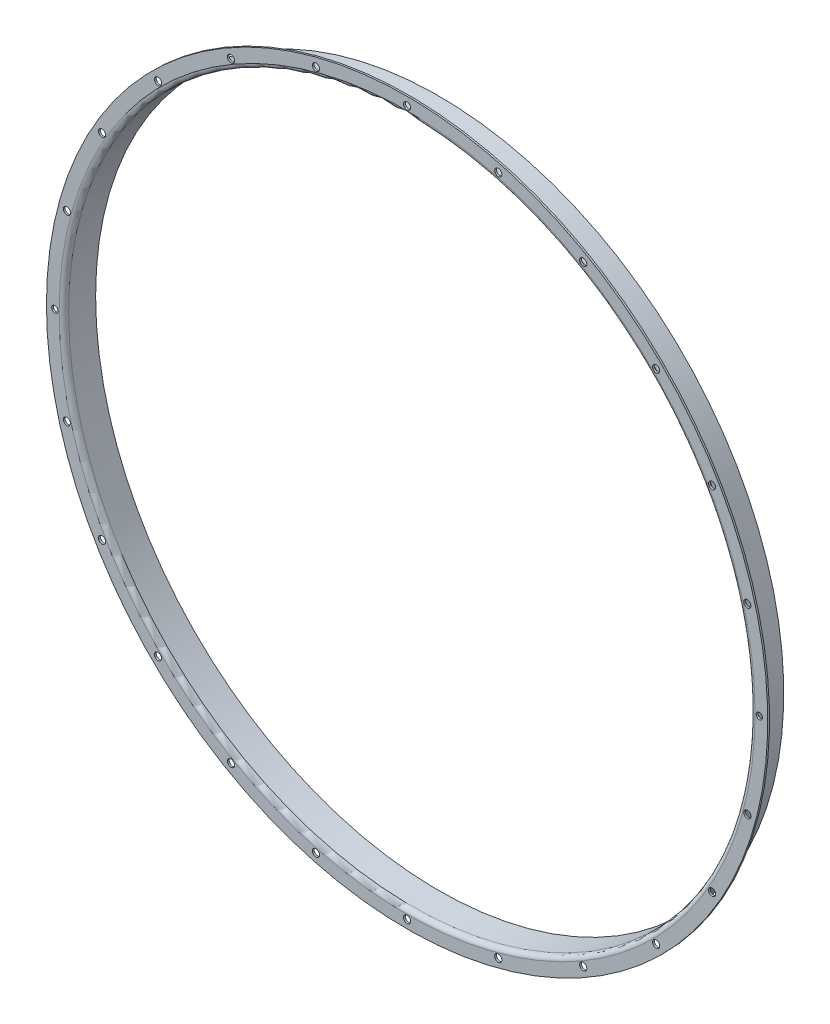
ISO-10303-21;
HEADER;
FILE_DESCRIPTION(('STEP AP214'),'2;1');
FILE_NAME('part.step','',(''),(''),'','','');
FILE_SCHEMA(('AUTOMOTIVE_DESIGN { 1 0 10303 214 1 1 1 1 }'));
ENDSEC;
DATA;
#1=APPLICATION_CONTEXT('core data for automotive mechanical design processes');
#2=APPLICATION_PROTOCOL_DEFINITION('international standard','automotive_design',2000,#1);
#3=PRODUCT_CONTEXT('',#1,'mechanical');
#4=PRODUCT('Part','Part','',(#3));
#5=PRODUCT_RELATED_PRODUCT_CATEGORY('part','',(#4));
#6=PRODUCT_DEFINITION_FORMATION('','',#4);
#7=PRODUCT_DEFINITION_CONTEXT('part definition',#1,'design');
#8=PRODUCT_DEFINITION('design','',#6,#7);
#9=PRODUCT_DEFINITION_SHAPE('','',#8);
#10=(LENGTH_UNIT() NAMED_UNIT(*) SI_UNIT(.MILLI.,.METRE.));
#11=(NAMED_UNIT(*) PLANE_ANGLE_UNIT() SI_UNIT($,.RADIAN.));
#12=(NAMED_UNIT(*) SI_UNIT($,.STERADIAN.) SOLID_ANGLE_UNIT());
#13=UNCERTAINTY_MEASURE_WITH_UNIT(LENGTH_MEASURE(1.E-05),#10,'distance_accuracy_value','');
#14=(GEOMETRIC_REPRESENTATION_CONTEXT(3) GLOBAL_UNCERTAINTY_ASSIGNED_CONTEXT((#13)) GLOBAL_UNIT_ASSIGNED_CONTEXT((#10,
#11,#12)) REPRESENTATION_CONTEXT('',''));
#15=CARTESIAN_POINT('',(0.,0.,0.));
#16=DIRECTION('',(0.,0.,1.));
#17=DIRECTION('',(1.,0.,0.));
#18=AXIS2_PLACEMENT_3D('',#15,#16,#17);
#19=CARTESIAN_POINT('',(0.,0.,0.));
#20=DIRECTION('',(0.,0.,-1.));
#21=DIRECTION('',(-1.,0.,0.));
#22=AXIS2_PLACEMENT_3D('',#19,#20,#21);
#23=CYLINDRICAL_SURFACE('',#22,227.325);
#24=CARTESIAN_POINT('',(0.,0.,0.));
#25=DIRECTION('',(0.,0.,-1.));
#26=DIRECTION('',(-1.,0.,0.));
#27=AXIS2_PLACEMENT_3D('',#24,#25,#26);
#28=CIRCLE('',#27,227.325);
#29=CARTESIAN_POINT('',(-227.325,0.,0.));
#30=VERTEX_POINT('',#29);
#31=EDGE_CURVE('E65',#30,#30,#28,.T.);
#32=ORIENTED_EDGE('',*,*,#31,.T.);
#33=EDGE_LOOP('',(#32));
#34=FACE_BOUND('',#33,.T.);
#35=CARTESIAN_POINT('',(0.,0.,-1.1));
#36=DIRECTION('',(0.,0.,-1.));
#37=DIRECTION('',(-1.,0.,0.));
#38=AXIS2_PLACEMENT_3D('',#35,#36,#37);
#39=CIRCLE('',#38,227.325);
#40=CARTESIAN_POINT('',(-227.325,0.,-1.1));
#41=VERTEX_POINT('',#40);
#42=EDGE_CURVE('E10',#41,#41,#39,.T.);
#43=ORIENTED_EDGE('',*,*,#42,.F.);
#44=EDGE_LOOP('',(#43));
#45=FACE_BOUND('',#44,.T.);
#46=ADVANCED_FACE('F37',(#34,#45),#23,.T.);
#47=CARTESIAN_POINT('',(0.,219.425,-1.1));
#48=DIRECTION('',(0.,0.,-1.));
#49=DIRECTION('',(-1.,0.,0.));
#50=AXIS2_PLACEMENT_3D('',#47,#48,#49);
#51=PLANE('',#50);
#52=CARTESIAN_POINT('',(57.4578280127567,214.435533436174,-1.1));
#53=DIRECTION('',(0.,0.,-1.));
#54=DIRECTION('',(-1.,0.,0.));
#55=AXIS2_PLACEMENT_3D('',#52,#53,#54);
#56=CIRCLE('',#55,2.25);
#57=CARTESIAN_POINT('',(55.2078280127567,214.435533436174,-1.1));
#58=VERTEX_POINT('',#57);
#59=EDGE_CURVE('E194',#58,#58,#56,.T.);
#60=ORIENTED_EDGE('',*,*,#59,.F.);
#61=EDGE_LOOP('',(#60));
#62=FACE_BOUND('',#61,.T.);
#63=CARTESIAN_POINT('',(110.999999999998,192.257639640147,-1.1));
#64=DIRECTION('',(0.,0.,-1.));
#65=DIRECTION('',(-1.,0.,0.));
#66=AXIS2_PLACEMENT_3D('',#63,#64,#65);
#67=CIRCLE('',#66,2.25);
#68=CARTESIAN_POINT('',(108.749999999998,192.257639640147,-1.1));
#69=VERTEX_POINT('',#68);
#70=EDGE_CURVE('E188',#69,#69,#67,.T.);
#71=ORIENTED_EDGE('',*,*,#70,.F.);
#72=EDGE_LOOP('',(#71));
#73=FACE_BOUND('',#72,.T.);
#74=CARTESIAN_POINT('',(156.977705423412,156.977705423415,-1.1));
#75=DIRECTION('',(0.,0.,-1.));
#76=DIRECTION('',(-1.,0.,0.));
#77=AXIS2_PLACEMENT_3D('',#74,#75,#76);
#78=CIRCLE('',#77,2.25);
#79=CARTESIAN_POINT('',(154.727705423412,156.977705423415,-1.1));
#80=VERTEX_POINT('',#79);
#81=EDGE_CURVE('E182',#80,#80,#78,.T.);
#82=ORIENTED_EDGE('',*,*,#81,.F.);
#83=EDGE_LOOP('',(#82));
#84=FACE_BOUND('',#83,.T.);
#85=CARTESIAN_POINT('',(192.257639640144,111.000000000002,-1.1));
#86=DIRECTION('',(0.,0.,-1.));
#87=DIRECTION('',(-1.,0.,0.));
#88=AXIS2_PLACEMENT_3D('',#85,#86,#87);
#89=CIRCLE('',#88,2.25);
#90=CARTESIAN_POINT('',(190.007639640144,111.000000000002,-1.1));
#91=VERTEX_POINT('',#90);
#92=EDGE_CURVE('E176',#91,#91,#89,.T.);
#93=ORIENTED_EDGE('',*,*,#92,.F.);
#94=EDGE_LOOP('',(#93));
#95=FACE_BOUND('',#94,.T.);
#96=CARTESIAN_POINT('',(214.435533436173,57.457828012762,-1.1));
#97=DIRECTION('',(0.,0.,-1.));
#98=DIRECTION('',(-1.,0.,0.));
#99=AXIS2_PLACEMENT_3D('',#96,#97,#98);
#100=CIRCLE('',#99,2.25);
#101=CARTESIAN_POINT('',(212.185533436173,57.457828012762,-1.1));
#102=VERTEX_POINT('',#101);
#103=EDGE_CURVE('E170',#102,#102,#100,.T.);
#104=ORIENTED_EDGE('',*,*,#103,.F.);
#105=EDGE_LOOP('',(#104));
#106=FACE_BOUND('',#105,.T.);
#107=CARTESIAN_POINT('',(214.435533436174,-57.4578280127575,-1.1));
#108=DIRECTION('',(0.,0.,-1.));
#109=DIRECTION('',(-1.,0.,0.));
#110=AXIS2_PLACEMENT_3D('',#107,#108,#109);
#111=CIRCLE('',#110,2.25);
#112=CARTESIAN_POINT('',(212.185533436174,-57.4578280127575,-1.1));
#113=VERTEX_POINT('',#112);
#114=EDGE_CURVE('E164',#113,#113,#111,.T.);
#115=ORIENTED_EDGE('',*,*,#114,.F.);
#116=EDGE_LOOP('',(#115));
#117=FACE_BOUND('',#116,.T.);
#118=CARTESIAN_POINT('',(192.257639640146,-110.999999999998,-1.1));
#119=DIRECTION('',(0.,0.,-1.));
#120=DIRECTION('',(-1.,0.,0.));
#121=AXIS2_PLACEMENT_3D('',#118,#119,#120);
#122=CIRCLE('',#121,2.25);
#123=CARTESIAN_POINT('',(190.007639640146,-110.999999999998,-1.1));
#124=VERTEX_POINT('',#123);
#125=EDGE_CURVE('E158',#124,#124,#122,.T.);
#126=ORIENTED_EDGE('',*,*,#125,.F.);
#127=EDGE_LOOP('',(#126));
#128=FACE_BOUND('',#127,.T.);
#129=CARTESIAN_POINT('',(156.977705423415,-156.977705423412,-1.1));
#130=DIRECTION('',(0.,0.,-1.));
#131=DIRECTION('',(-1.,0.,0.));
#132=AXIS2_PLACEMENT_3D('',#129,#130,#131);
#133=CIRCLE('',#132,2.25);
#134=CARTESIAN_POINT('',(154.727705423415,-156.977705423412,-1.1));
#135=VERTEX_POINT('',#134);
#136=EDGE_CURVE('E152',#135,#135,#133,.T.);
#137=ORIENTED_EDGE('',*,*,#136,.F.);
#138=EDGE_LOOP('',(#137));
#139=FACE_BOUND('',#138,.T.);
#140=CARTESIAN_POINT('',(111.000000000002,-192.257639640144,-1.1));
#141=DIRECTION('',(0.,0.,-1.));
#142=DIRECTION('',(-1.,0.,0.));
#143=AXIS2_PLACEMENT_3D('',#140,#141,#142);
#144=CIRCLE('',#143,2.25);
#145=CARTESIAN_POINT('',(108.750000000002,-192.257639640144,-1.1));
#146=VERTEX_POINT('',#145);
#147=EDGE_CURVE('E146',#146,#146,#144,.T.);
#148=ORIENTED_EDGE('',*,*,#147,.F.);
#149=EDGE_LOOP('',(#148));
#150=FACE_BOUND('',#149,.T.);
#151=CARTESIAN_POINT('',(57.4578280127612,-214.435533436173,-1.1));
#152=DIRECTION('',(0.,0.,-1.));
#153=DIRECTION('',(-1.,0.,0.));
#154=AXIS2_PLACEMENT_3D('',#151,#152,#153);
#155=CIRCLE('',#154,2.25);
#156=CARTESIAN_POINT('',(55.2078280127612,-214.435533436173,-1.1));
#157=VERTEX_POINT('',#156);
#158=EDGE_CURVE('E140',#157,#157,#155,.T.);
#159=ORIENTED_EDGE('',*,*,#158,.F.);
#160=EDGE_LOOP('',(#159));
#161=FACE_BOUND('',#160,.T.);
#162=CARTESIAN_POINT('',(0.,-222.,-1.1));
#163=DIRECTION('',(0.,0.,-1.));
#164=DIRECTION('',(-1.,0.,0.));
#165=AXIS2_PLACEMENT_3D('',#162,#163,#164);
#166=CIRCLE('',#165,2.25);
#167=CARTESIAN_POINT('',(-2.25,-222.,-1.1));
#168=VERTEX_POINT('',#167);
#169=EDGE_CURVE('E134',#168,#168,#166,.T.);
#170=ORIENTED_EDGE('',*,*,#169,.F.);
#171=EDGE_LOOP('',(#170));
#172=FACE_BOUND('',#171,.T.);
#173=CARTESIAN_POINT('',(-57.4578280127582,-214.435533436174,-1.1));
#174=DIRECTION('',(0.,0.,-1.));
#175=DIRECTION('',(-1.,0.,0.));
#176=AXIS2_PLACEMENT_3D('',#173,#174,#175);
#177=CIRCLE('',#176,2.25);
#178=CARTESIAN_POINT('',(-59.7078280127582,-214.435533436174,-1.1));
#179=VERTEX_POINT('',#178);
#180=EDGE_CURVE('E128',#179,#179,#177,.T.);
#181=ORIENTED_EDGE('',*,*,#180,.F.);
#182=EDGE_LOOP('',(#181));
#183=FACE_BOUND('',#182,.T.);
#184=CARTESIAN_POINT('',(-110.999999999999,-192.257639640146,-1.1));
#185=DIRECTION('',(0.,0.,-1.));
#186=DIRECTION('',(-1.,0.,0.));
#187=AXIS2_PLACEMENT_3D('',#184,#185,#186);
#188=CIRCLE('',#187,2.25);
#189=CARTESIAN_POINT('',(-113.249999999999,-192.257639640146,-1.1));
#190=VERTEX_POINT('',#189);
#191=EDGE_CURVE('E122',#190,#190,#188,.T.);
#192=ORIENTED_EDGE('',*,*,#191,.F.);
#193=EDGE_LOOP('',(#192));
#194=FACE_BOUND('',#193,.T.);
#195=CARTESIAN_POINT('',(-156.977705423413,-156.977705423414,-1.1));
#196=DIRECTION('',(0.,0.,-1.));
#197=DIRECTION('',(-1.,0.,0.));
#198=AXIS2_PLACEMENT_3D('',#195,#196,#197);
#199=CIRCLE('',#198,2.25);
#200=CARTESIAN_POINT('',(-159.227705423413,-156.977705423414,-1.1));
#201=VERTEX_POINT('',#200);
#202=EDGE_CURVE('E116',#201,#201,#199,.T.);
#203=ORIENTED_EDGE('',*,*,#202,.F.);
#204=EDGE_LOOP('',(#203));
#205=FACE_BOUND('',#204,.T.);
#206=CARTESIAN_POINT('',(-192.257639640145,-111.000000000001,-1.1));
#207=DIRECTION('',(0.,0.,-1.));
#208=DIRECTION('',(-1.,0.,0.));
#209=AXIS2_PLACEMENT_3D('',#206,#207,#208);
#210=CIRCLE('',#209,2.25);
#211=CARTESIAN_POINT('',(-194.507639640145,-111.000000000001,-1.1));
#212=VERTEX_POINT('',#211);
#213=EDGE_CURVE('E110',#212,#212,#210,.T.);
#214=ORIENTED_EDGE('',*,*,#213,.F.);
#215=EDGE_LOOP('',(#214));
#216=FACE_BOUND('',#215,.T.);
#217=CARTESIAN_POINT('',(-214.435533436173,-57.4578280127605,-1.1));
#218=DIRECTION('',(0.,0.,-1.));
#219=DIRECTION('',(-1.,0.,0.));
#220=AXIS2_PLACEMENT_3D('',#217,#218,#219);
#221=CIRCLE('',#220,2.25);
#222=CARTESIAN_POINT('',(-216.685533436173,-57.4578280127605,-1.1));
#223=VERTEX_POINT('',#222);
#224=EDGE_CURVE('E104',#223,#223,#221,.T.);
#225=ORIENTED_EDGE('',*,*,#224,.F.);
#226=EDGE_LOOP('',(#225));
#227=FACE_BOUND('',#226,.T.);
#228=CARTESIAN_POINT('',(-214.435533436173,57.457828012759,-1.1));
#229=DIRECTION('',(0.,0.,-1.));
#230=DIRECTION('',(-1.,0.,0.));
#231=AXIS2_PLACEMENT_3D('',#228,#229,#230);
#232=CIRCLE('',#231,2.25);
#233=CARTESIAN_POINT('',(-216.685533436173,57.457828012759,-1.1));
#234=VERTEX_POINT('',#233);
#235=EDGE_CURVE('E98',#234,#234,#232,.T.);
#236=ORIENTED_EDGE('',*,*,#235,.F.);
#237=EDGE_LOOP('',(#236));
#238=FACE_BOUND('',#237,.T.);
#239=CARTESIAN_POINT('',(-192.257639640146,111.,-1.1));
#240=DIRECTION('',(0.,0.,-1.));
#241=DIRECTION('',(-1.,0.,0.));
#242=AXIS2_PLACEMENT_3D('',#239,#240,#241);
#243=CIRCLE('',#242,2.25);
#244=CARTESIAN_POINT('',(-194.507639640146,111.,-1.1));
#245=VERTEX_POINT('',#244);
#246=EDGE_CURVE('E92',#245,#245,#243,.T.);
#247=ORIENTED_EDGE('',*,*,#246,.F.);
#248=EDGE_LOOP('',(#247));
#249=FACE_BOUND('',#248,.T.);
#250=CARTESIAN_POINT('',(-156.977705423414,156.977705423413,-1.1));
#251=DIRECTION('',(0.,0.,-1.));
#252=DIRECTION('',(-1.,0.,0.));
#253=AXIS2_PLACEMENT_3D('',#250,#251,#252);
#254=CIRCLE('',#253,2.25);
#255=CARTESIAN_POINT('',(-159.227705423414,156.977705423413,-1.1));
#256=VERTEX_POINT('',#255);
#257=EDGE_CURVE('E86',#256,#256,#254,.T.);
#258=ORIENTED_EDGE('',*,*,#257,.F.);
#259=EDGE_LOOP('',(#258));
#260=FACE_BOUND('',#259,.T.);
#261=CARTESIAN_POINT('',(-111.,192.257639640145,-1.1));
#262=DIRECTION('',(0.,0.,-1.));
#263=DIRECTION('',(-1.,0.,0.));
#264=AXIS2_PLACEMENT_3D('',#261,#262,#263);
#265=CIRCLE('',#264,2.25);
#266=CARTESIAN_POINT('',(-113.25,192.257639640145,-1.1));
#267=VERTEX_POINT('',#266);
#268=EDGE_CURVE('E80',#267,#267,#265,.T.);
#269=ORIENTED_EDGE('',*,*,#268,.F.);
#270=EDGE_LOOP('',(#269));
#271=FACE_BOUND('',#270,.T.);
#272=CARTESIAN_POINT('',(-57.4578280127597,214.435533436173,-1.1));
#273=DIRECTION('',(0.,0.,-1.));
#274=DIRECTION('',(-1.,0.,0.));
#275=AXIS2_PLACEMENT_3D('',#272,#273,#274);
#276=CIRCLE('',#275,2.25);
#277=CARTESIAN_POINT('',(-59.7078280127597,214.435533436173,-1.1));
#278=VERTEX_POINT('',#277);
#279=EDGE_CURVE('E74',#278,#278,#276,.T.);
#280=ORIENTED_EDGE('',*,*,#279,.F.);
#281=EDGE_LOOP('',(#280));
#282=FACE_BOUND('',#281,.T.);
#283=CARTESIAN_POINT('',(0.,222.,-1.1));
#284=DIRECTION('',(0.,0.,-1.));
#285=DIRECTION('',(-1.,0.,0.));
#286=AXIS2_PLACEMENT_3D('',#283,#284,#285);
#287=CIRCLE('',#286,2.25);
#288=CARTESIAN_POINT('',(-2.25,222.,-1.1));
#289=VERTEX_POINT('',#288);
#290=EDGE_CURVE('E68',#289,#289,#287,.T.);
#291=ORIENTED_EDGE('',*,*,#290,.F.);
#292=EDGE_LOOP('',(#291));
#293=FACE_BOUND('',#292,.T.);
#294=ORIENTED_EDGE('',*,*,#42,.T.);
#295=EDGE_LOOP('',(#294));
#296=FACE_BOUND('',#295,.T.);
#297=CARTESIAN_POINT('',(0.,0.,-1.1));
#298=DIRECTION('',(0.,0.,-1.));
#299=DIRECTION('',(-1.,0.,0.));
#300=AXIS2_PLACEMENT_3D('',#297,#298,#299);
#301=CIRCLE('',#300,219.425);
#302=CARTESIAN_POINT('',(-219.425,0.,-1.1));
#303=VERTEX_POINT('',#302);
#304=EDGE_CURVE('E43',#303,#303,#301,.T.);
#305=ORIENTED_EDGE('',*,*,#304,.F.);
#306=EDGE_LOOP('',(#305));
#307=FACE_BOUND('',#306,.T.);
#308=CARTESIAN_POINT('',(-222.,-7.74891763399207E-13,-1.1));
#309=DIRECTION('',(0.,0.,-1.));
#310=DIRECTION('',(-1.,0.,0.));
#311=AXIS2_PLACEMENT_3D('',#308,#309,#310);
#312=CIRCLE('',#311,2.);
#313=CARTESIAN_POINT('',(-224.,-7.74891763399207E-13,-1.1));
#314=VERTEX_POINT('',#313);
#315=EDGE_CURVE('E200',#314,#314,#312,.F.);
#316=ORIENTED_EDGE('',*,*,#315,.T.);
#317=EDGE_LOOP('',(#316));
#318=FACE_BOUND('',#317,.T.);
#319=CARTESIAN_POINT('',(222.,2.32510947784556E-12,-1.1));
#320=DIRECTION('',(0.,0.,-1.));
#321=DIRECTION('',(-1.,0.,0.));
#322=AXIS2_PLACEMENT_3D('',#319,#320,#321);
#323=CIRCLE('',#322,2.);
#324=CARTESIAN_POINT('',(220.,2.32510947784556E-12,-1.1));
#325=VERTEX_POINT('',#324);
#326=EDGE_CURVE('E206',#325,#325,#323,.F.);
#327=ORIENTED_EDGE('',*,*,#326,.T.);
#328=EDGE_LOOP('',(#327));
#329=FACE_BOUND('',#328,.T.);
#330=ADVANCED_FACE('F235',(#62,#73,#84,#95,#106,#117,#128,#139,#150,#161,#172,#183,#194,#205,
#216,#227,#238,#249,#260,#271,#282,#293,#296,#307,#318,#329),#51,.T.);
#331=CARTESIAN_POINT('',(0.,0.,-3.1));
#332=DIRECTION('',(0.,0.,-1.));
#333=DIRECTION('',(-1.,0.,0.));
#334=AXIS2_PLACEMENT_3D('',#331,#332,#333);
#335=TOROIDAL_SURFACE('',#334,219.425,2.);
#336=ORIENTED_EDGE('',*,*,#304,.T.);
#337=EDGE_LOOP('',(#336));
#338=FACE_BOUND('',#337,.T.);
#339=CARTESIAN_POINT('',(0.,0.,-3.1));
#340=DIRECTION('',(0.,0.,-1.));
#341=DIRECTION('',(-1.,0.,0.));
#342=AXIS2_PLACEMENT_3D('',#339,#340,#341);
#343=CIRCLE('',#342,217.425);
#344=CARTESIAN_POINT('',(-217.425,0.,-3.1));
#345=VERTEX_POINT('',#344);
#346=EDGE_CURVE('E47',#345,#345,#343,.T.);
#347=ORIENTED_EDGE('',*,*,#346,.F.);
#348=EDGE_LOOP('',(#347));
#349=FACE_BOUND('',#348,.T.);
#350=ADVANCED_FACE('F240',(#338,#349),#335,.F.);
#351=CARTESIAN_POINT('',(0.,0.,0.));
#352=DIRECTION('',(0.,0.,-1.));
#353=DIRECTION('',(-1.,0.,0.));
#354=AXIS2_PLACEMENT_3D('',#351,#352,#353);
#355=CYLINDRICAL_SURFACE('',#354,217.425);
#356=ORIENTED_EDGE('',*,*,#346,.T.);
#357=EDGE_LOOP('',(#356));
#358=FACE_BOUND('',#357,.T.);
#359=CARTESIAN_POINT('',(0.,0.,-20.));
#360=DIRECTION('',(0.,0.,-1.));
#361=DIRECTION('',(-1.,0.,0.));
#362=AXIS2_PLACEMENT_3D('',#359,#360,#361);
#363=CIRCLE('',#362,217.425);
#364=CARTESIAN_POINT('',(-217.425,0.,-20.));
#365=VERTEX_POINT('',#364);
#366=EDGE_CURVE('E51',#365,#365,#363,.T.);
#367=ORIENTED_EDGE('',*,*,#366,.F.);
#368=EDGE_LOOP('',(#367));
#369=FACE_BOUND('',#368,.T.);
#370=ADVANCED_FACE('F469',(#358,#369),#355,.T.);
#371=CARTESIAN_POINT('',(0.,216.325,-20.));
#372=DIRECTION('',(0.,0.,-1.));
#373=DIRECTION('',(-1.,0.,0.));
#374=AXIS2_PLACEMENT_3D('',#371,#372,#373);
#375=PLANE('',#374);
#376=ORIENTED_EDGE('',*,*,#366,.T.);
#377=EDGE_LOOP('',(#376));
#378=FACE_BOUND('',#377,.T.);
#379=CARTESIAN_POINT('',(0.,0.,-20.));
#380=DIRECTION('',(0.,0.,-1.));
#381=DIRECTION('',(-1.,0.,0.));
#382=AXIS2_PLACEMENT_3D('',#379,#380,#381);
#383=CIRCLE('',#382,216.325);
#384=CARTESIAN_POINT('',(-216.325,0.,-20.));
#385=VERTEX_POINT('',#384);
#386=EDGE_CURVE('E56',#385,#385,#383,.T.);
#387=ORIENTED_EDGE('',*,*,#386,.F.);
#388=EDGE_LOOP('',(#387));
#389=FACE_BOUND('',#388,.T.);
#390=ADVANCED_FACE('F476',(#378,#389),#375,.T.);
#391=CARTESIAN_POINT('',(0.,0.,0.));
#392=DIRECTION('',(0.,0.,-1.));
#393=DIRECTION('',(-1.,0.,0.));
#394=AXIS2_PLACEMENT_3D('',#391,#392,#393);
#395=CYLINDRICAL_SURFACE('',#394,216.325);
#396=ORIENTED_EDGE('',*,*,#386,.T.);
#397=EDGE_LOOP('',(#396));
#398=FACE_BOUND('',#397,.T.);
#399=CARTESIAN_POINT('',(0.,0.,-3.));
#400=DIRECTION('',(0.,0.,-1.));
#401=DIRECTION('',(-1.,0.,0.));
#402=AXIS2_PLACEMENT_3D('',#399,#400,#401);
#403=CIRCLE('',#402,216.325);
#404=CARTESIAN_POINT('',(-216.325,0.,-3.));
#405=VERTEX_POINT('',#404);
#406=EDGE_CURVE('E59',#405,#405,#403,.T.);
#407=ORIENTED_EDGE('',*,*,#406,.F.);
#408=EDGE_LOOP('',(#407));
#409=FACE_BOUND('',#408,.T.);
#410=ADVANCED_FACE('F229',(#398,#409),#395,.F.);
#411=CARTESIAN_POINT('',(0.,0.,-3.));
#412=DIRECTION('',(0.,0.,-1.));
#413=DIRECTION('',(-1.,0.,0.));
#414=AXIS2_PLACEMENT_3D('',#411,#412,#413);
#415=TOROIDAL_SURFACE('',#414,219.325,3.);
#416=ORIENTED_EDGE('',*,*,#406,.T.);
#417=EDGE_LOOP('',(#416));
#418=FACE_BOUND('',#417,.T.);
#419=CARTESIAN_POINT('',(0.,0.,0.));
#420=DIRECTION('',(0.,0.,-1.));
#421=DIRECTION('',(-1.,0.,0.));
#422=AXIS2_PLACEMENT_3D('',#419,#420,#421);
#423=CIRCLE('',#422,219.325);
#424=CARTESIAN_POINT('',(-219.325,0.,0.));
#425=VERTEX_POINT('',#424);
#426=EDGE_CURVE('E62',#425,#425,#423,.T.);
#427=ORIENTED_EDGE('',*,*,#426,.F.);
#428=EDGE_LOOP('',(#427));
#429=FACE_BOUND('',#428,.T.);
#430=ADVANCED_FACE('F219',(#418,#429),#415,.T.);
#431=CARTESIAN_POINT('',(0.,227.325,0.));
#432=DIRECTION('',(0.,0.,1.));
#433=DIRECTION('',(1.,0.,0.));
#434=AXIS2_PLACEMENT_3D('',#431,#432,#433);
#435=PLANE('',#434);
#436=CARTESIAN_POINT('',(57.4578280127567,214.435533436174,0.));
#437=DIRECTION('',(0.,0.,1.));
#438=DIRECTION('',(1.,0.,0.));
#439=AXIS2_PLACEMENT_3D('',#436,#437,#438);
#440=CIRCLE('',#439,2.25);
#441=CARTESIAN_POINT('',(59.7078280127567,214.435533436174,0.));
#442=VERTEX_POINT('',#441);
#443=EDGE_CURVE('E197',#442,#442,#440,.T.);
#444=ORIENTED_EDGE('',*,*,#443,.F.);
#445=EDGE_LOOP('',(#444));
#446=FACE_BOUND('',#445,.T.);
#447=CARTESIAN_POINT('',(110.999999999998,192.257639640147,0.));
#448=DIRECTION('',(0.,0.,1.));
#449=DIRECTION('',(1.,0.,0.));
#450=AXIS2_PLACEMENT_3D('',#447,#448,#449);
#451=CIRCLE('',#450,2.25);
#452=CARTESIAN_POINT('',(113.249999999998,192.257639640147,0.));
#453=VERTEX_POINT('',#452);
#454=EDGE_CURVE('E191',#453,#453,#451,.T.);
#455=ORIENTED_EDGE('',*,*,#454,.F.);
#456=EDGE_LOOP('',(#455));
#457=FACE_BOUND('',#456,.T.);
#458=CARTESIAN_POINT('',(156.977705423412,156.977705423415,0.));
#459=DIRECTION('',(0.,0.,1.));
#460=DIRECTION('',(1.,0.,0.));
#461=AXIS2_PLACEMENT_3D('',#458,#459,#460);
#462=CIRCLE('',#461,2.25);
#463=CARTESIAN_POINT('',(159.227705423412,156.977705423415,0.));
#464=VERTEX_POINT('',#463);
#465=EDGE_CURVE('E185',#464,#464,#462,.T.);
#466=ORIENTED_EDGE('',*,*,#465,.F.);
#467=EDGE_LOOP('',(#466));
#468=FACE_BOUND('',#467,.T.);
#469=CARTESIAN_POINT('',(192.257639640144,111.000000000002,0.));
#470=DIRECTION('',(0.,0.,1.));
#471=DIRECTION('',(1.,0.,0.));
#472=AXIS2_PLACEMENT_3D('',#469,#470,#471);
#473=CIRCLE('',#472,2.25);
#474=CARTESIAN_POINT('',(194.507639640144,111.000000000002,0.));
#475=VERTEX_POINT('',#474);
#476=EDGE_CURVE('E179',#475,#475,#473,.T.);
#477=ORIENTED_EDGE('',*,*,#476,.F.);
#478=EDGE_LOOP('',(#477));
#479=FACE_BOUND('',#478,.T.);
#480=CARTESIAN_POINT('',(214.435533436173,57.457828012762,0.));
#481=DIRECTION('',(0.,0.,1.));
#482=DIRECTION('',(1.,0.,0.));
#483=AXIS2_PLACEMENT_3D('',#480,#481,#482);
#484=CIRCLE('',#483,2.25);
#485=CARTESIAN_POINT('',(216.685533436173,57.457828012762,0.));
#486=VERTEX_POINT('',#485);
#487=EDGE_CURVE('E173',#486,#486,#484,.T.);
#488=ORIENTED_EDGE('',*,*,#487,.F.);
#489=EDGE_LOOP('',(#488));
#490=FACE_BOUND('',#489,.T.);
#491=CARTESIAN_POINT('',(214.435533436174,-57.4578280127575,0.));
#492=DIRECTION('',(0.,0.,1.));
#493=DIRECTION('',(1.,0.,0.));
#494=AXIS2_PLACEMENT_3D('',#491,#492,#493);
#495=CIRCLE('',#494,2.25);
#496=CARTESIAN_POINT('',(216.685533436174,-57.4578280127575,0.));
#497=VERTEX_POINT('',#496);
#498=EDGE_CURVE('E167',#497,#497,#495,.T.);
#499=ORIENTED_EDGE('',*,*,#498,.F.);
#500=EDGE_LOOP('',(#499));
#501=FACE_BOUND('',#500,.T.);
#502=CARTESIAN_POINT('',(192.257639640146,-110.999999999998,0.));
#503=DIRECTION('',(0.,0.,1.));
#504=DIRECTION('',(1.,0.,0.));
#505=AXIS2_PLACEMENT_3D('',#502,#503,#504);
#506=CIRCLE('',#505,2.25);
#507=CARTESIAN_POINT('',(194.507639640146,-110.999999999998,0.));
#508=VERTEX_POINT('',#507);
#509=EDGE_CURVE('E161',#508,#508,#506,.T.);
#510=ORIENTED_EDGE('',*,*,#509,.F.);
#511=EDGE_LOOP('',(#510));
#512=FACE_BOUND('',#511,.T.);
#513=CARTESIAN_POINT('',(156.977705423415,-156.977705423412,0.));
#514=DIRECTION('',(0.,0.,1.));
#515=DIRECTION('',(1.,0.,0.));
#516=AXIS2_PLACEMENT_3D('',#513,#514,#515);
#517=CIRCLE('',#516,2.25);
#518=CARTESIAN_POINT('',(159.227705423415,-156.977705423412,0.));
#519=VERTEX_POINT('',#518);
#520=EDGE_CURVE('E155',#519,#519,#517,.T.);
#521=ORIENTED_EDGE('',*,*,#520,.F.);
#522=EDGE_LOOP('',(#521));
#523=FACE_BOUND('',#522,.T.);
#524=CARTESIAN_POINT('',(111.000000000002,-192.257639640144,0.));
#525=DIRECTION('',(0.,0.,1.));
#526=DIRECTION('',(1.,0.,0.));
#527=AXIS2_PLACEMENT_3D('',#524,#525,#526);
#528=CIRCLE('',#527,2.25);
#529=CARTESIAN_POINT('',(113.250000000002,-192.257639640144,0.));
#530=VERTEX_POINT('',#529);
#531=EDGE_CURVE('E149',#530,#530,#528,.T.);
#532=ORIENTED_EDGE('',*,*,#531,.F.);
#533=EDGE_LOOP('',(#532));
#534=FACE_BOUND('',#533,.T.);
#535=CARTESIAN_POINT('',(57.4578280127612,-214.435533436173,0.));
#536=DIRECTION('',(0.,0.,1.));
#537=DIRECTION('',(1.,0.,0.));
#538=AXIS2_PLACEMENT_3D('',#535,#536,#537);
#539=CIRCLE('',#538,2.25);
#540=CARTESIAN_POINT('',(59.7078280127612,-214.435533436173,0.));
#541=VERTEX_POINT('',#540);
#542=EDGE_CURVE('E143',#541,#541,#539,.T.);
#543=ORIENTED_EDGE('',*,*,#542,.F.);
#544=EDGE_LOOP('',(#543));
#545=FACE_BOUND('',#544,.T.);
#546=CARTESIAN_POINT('',(0.,-222.,0.));
#547=DIRECTION('',(0.,0.,1.));
#548=DIRECTION('',(1.,0.,0.));
#549=AXIS2_PLACEMENT_3D('',#546,#547,#548);
#550=CIRCLE('',#549,2.25);
#551=CARTESIAN_POINT('',(2.25,-222.,0.));
#552=VERTEX_POINT('',#551);
#553=EDGE_CURVE('E137',#552,#552,#550,.T.);
#554=ORIENTED_EDGE('',*,*,#553,.F.);
#555=EDGE_LOOP('',(#554));
#556=FACE_BOUND('',#555,.T.);
#557=CARTESIAN_POINT('',(-57.4578280127582,-214.435533436174,0.));
#558=DIRECTION('',(0.,0.,1.));
#559=DIRECTION('',(1.,0.,0.));
#560=AXIS2_PLACEMENT_3D('',#557,#558,#559);
#561=CIRCLE('',#560,2.25);
#562=CARTESIAN_POINT('',(-55.2078280127582,-214.435533436174,0.));
#563=VERTEX_POINT('',#562);
#564=EDGE_CURVE('E131',#563,#563,#561,.T.);
#565=ORIENTED_EDGE('',*,*,#564,.F.);
#566=EDGE_LOOP('',(#565));
#567=FACE_BOUND('',#566,.T.);
#568=CARTESIAN_POINT('',(-110.999999999999,-192.257639640146,0.));
#569=DIRECTION('',(0.,0.,1.));
#570=DIRECTION('',(1.,0.,0.));
#571=AXIS2_PLACEMENT_3D('',#568,#569,#570);
#572=CIRCLE('',#571,2.25);
#573=CARTESIAN_POINT('',(-108.749999999999,-192.257639640146,0.));
#574=VERTEX_POINT('',#573);
#575=EDGE_CURVE('E125',#574,#574,#572,.T.);
#576=ORIENTED_EDGE('',*,*,#575,.F.);
#577=EDGE_LOOP('',(#576));
#578=FACE_BOUND('',#577,.T.);
#579=CARTESIAN_POINT('',(-156.977705423413,-156.977705423414,0.));
#580=DIRECTION('',(0.,0.,1.));
#581=DIRECTION('',(1.,0.,0.));
#582=AXIS2_PLACEMENT_3D('',#579,#580,#581);
#583=CIRCLE('',#582,2.25);
#584=CARTESIAN_POINT('',(-154.727705423413,-156.977705423414,0.));
#585=VERTEX_POINT('',#584);
#586=EDGE_CURVE('E119',#585,#585,#583,.T.);
#587=ORIENTED_EDGE('',*,*,#586,.F.);
#588=EDGE_LOOP('',(#587));
#589=FACE_BOUND('',#588,.T.);
#590=CARTESIAN_POINT('',(-192.257639640145,-111.000000000001,0.));
#591=DIRECTION('',(0.,0.,1.));
#592=DIRECTION('',(1.,0.,0.));
#593=AXIS2_PLACEMENT_3D('',#590,#591,#592);
#594=CIRCLE('',#593,2.25);
#595=CARTESIAN_POINT('',(-190.007639640145,-111.000000000001,0.));
#596=VERTEX_POINT('',#595);
#597=EDGE_CURVE('E113',#596,#596,#594,.T.);
#598=ORIENTED_EDGE('',*,*,#597,.F.);
#599=EDGE_LOOP('',(#598));
#600=FACE_BOUND('',#599,.T.);
#601=CARTESIAN_POINT('',(-214.435533436173,-57.4578280127605,0.));
#602=DIRECTION('',(0.,0.,1.));
#603=DIRECTION('',(1.,0.,0.));
#604=AXIS2_PLACEMENT_3D('',#601,#602,#603);
#605=CIRCLE('',#604,2.25);
#606=CARTESIAN_POINT('',(-212.185533436173,-57.4578280127605,0.));
#607=VERTEX_POINT('',#606);
#608=EDGE_CURVE('E107',#607,#607,#605,.T.);
#609=ORIENTED_EDGE('',*,*,#608,.F.);
#610=EDGE_LOOP('',(#609));
#611=FACE_BOUND('',#610,.T.);
#612=CARTESIAN_POINT('',(-214.435533436173,57.457828012759,0.));
#613=DIRECTION('',(0.,0.,1.));
#614=DIRECTION('',(1.,0.,0.));
#615=AXIS2_PLACEMENT_3D('',#612,#613,#614);
#616=CIRCLE('',#615,2.25);
#617=CARTESIAN_POINT('',(-212.185533436173,57.457828012759,0.));
#618=VERTEX_POINT('',#617);
#619=EDGE_CURVE('E101',#618,#618,#616,.T.);
#620=ORIENTED_EDGE('',*,*,#619,.F.);
#621=EDGE_LOOP('',(#620));
#622=FACE_BOUND('',#621,.T.);
#623=CARTESIAN_POINT('',(-192.257639640146,111.,0.));
#624=DIRECTION('',(0.,0.,1.));
#625=DIRECTION('',(1.,0.,0.));
#626=AXIS2_PLACEMENT_3D('',#623,#624,#625);
#627=CIRCLE('',#626,2.25);
#628=CARTESIAN_POINT('',(-190.007639640146,111.,0.));
#629=VERTEX_POINT('',#628);
#630=EDGE_CURVE('E95',#629,#629,#627,.T.);
#631=ORIENTED_EDGE('',*,*,#630,.F.);
#632=EDGE_LOOP('',(#631));
#633=FACE_BOUND('',#632,.T.);
#634=CARTESIAN_POINT('',(-156.977705423414,156.977705423413,0.));
#635=DIRECTION('',(0.,0.,1.));
#636=DIRECTION('',(1.,0.,0.));
#637=AXIS2_PLACEMENT_3D('',#634,#635,#636);
#638=CIRCLE('',#637,2.25);
#639=CARTESIAN_POINT('',(-154.727705423414,156.977705423413,0.));
#640=VERTEX_POINT('',#639);
#641=EDGE_CURVE('E89',#640,#640,#638,.T.);
#642=ORIENTED_EDGE('',*,*,#641,.F.);
#643=EDGE_LOOP('',(#642));
#644=FACE_BOUND('',#643,.T.);
#645=CARTESIAN_POINT('',(-111.,192.257639640145,0.));
#646=DIRECTION('',(0.,0.,1.));
#647=DIRECTION('',(1.,0.,0.));
#648=AXIS2_PLACEMENT_3D('',#645,#646,#647);
#649=CIRCLE('',#648,2.25);
#650=CARTESIAN_POINT('',(-108.75,192.257639640145,0.));
#651=VERTEX_POINT('',#650);
#652=EDGE_CURVE('E83',#651,#651,#649,.T.);
#653=ORIENTED_EDGE('',*,*,#652,.F.);
#654=EDGE_LOOP('',(#653));
#655=FACE_BOUND('',#654,.T.);
#656=CARTESIAN_POINT('',(-57.4578280127597,214.435533436173,0.));
#657=DIRECTION('',(0.,0.,1.));
#658=DIRECTION('',(1.,0.,0.));
#659=AXIS2_PLACEMENT_3D('',#656,#657,#658);
#660=CIRCLE('',#659,2.25);
#661=CARTESIAN_POINT('',(-55.2078280127597,214.435533436173,0.));
#662=VERTEX_POINT('',#661);
#663=EDGE_CURVE('E77',#662,#662,#660,.T.);
#664=ORIENTED_EDGE('',*,*,#663,.F.);
#665=EDGE_LOOP('',(#664));
#666=FACE_BOUND('',#665,.T.);
#667=CARTESIAN_POINT('',(0.,222.,0.));
#668=DIRECTION('',(0.,0.,1.));
#669=DIRECTION('',(1.,0.,0.));
#670=AXIS2_PLACEMENT_3D('',#667,#668,#669);
#671=CIRCLE('',#670,2.25);
#672=CARTESIAN_POINT('',(2.25,222.,0.));
#673=VERTEX_POINT('',#672);
#674=EDGE_CURVE('E71',#673,#673,#671,.T.);
#675=ORIENTED_EDGE('',*,*,#674,.F.);
#676=EDGE_LOOP('',(#675));
#677=FACE_BOUND('',#676,.T.);
#678=ORIENTED_EDGE('',*,*,#426,.T.);
#679=EDGE_LOOP('',(#678));
#680=FACE_BOUND('',#679,.T.);
#681=ORIENTED_EDGE('',*,*,#31,.F.);
#682=EDGE_LOOP('',(#681));
#683=FACE_BOUND('',#682,.T.);
#684=CARTESIAN_POINT('',(-222.,-7.74891763399207E-13,0.));
#685=DIRECTION('',(0.,0.,1.));
#686=DIRECTION('',(1.,0.,0.));
#687=AXIS2_PLACEMENT_3D('',#684,#685,#686);
#688=CIRCLE('',#687,2.);
#689=CARTESIAN_POINT('',(-220.,-7.74891763399207E-13,0.));
#690=VERTEX_POINT('',#689);
#691=EDGE_CURVE('E203',#690,#690,#688,.T.);
#692=ORIENTED_EDGE('',*,*,#691,.F.);
#693=EDGE_LOOP('',(#692));
#694=FACE_BOUND('',#693,.T.);
#695=CARTESIAN_POINT('',(222.,2.32510947784556E-12,0.));
#696=DIRECTION('',(0.,0.,1.));
#697=DIRECTION('',(1.,0.,0.));
#698=AXIS2_PLACEMENT_3D('',#695,#696,#697);
#699=CIRCLE('',#698,2.);
#700=CARTESIAN_POINT('',(224.,2.32510947784556E-12,0.));
#701=VERTEX_POINT('',#700);
#702=EDGE_CURVE('E209',#701,#701,#699,.T.);
#703=ORIENTED_EDGE('',*,*,#702,.F.);
#704=EDGE_LOOP('',(#703));
#705=FACE_BOUND('',#704,.T.);
#706=ADVANCED_FACE('F216',(#446,#457,#468,#479,#490,#501,#512,#523,#534,#545,#556,#567,#578,
#589,#600,#611,#622,#633,#644,#655,#666,#677,#680,#683,#694,#705),#435,.T.);
#707=CARTESIAN_POINT('',(0.,222.,0.));
#708=DIRECTION('',(0.,0.,1.));
#709=DIRECTION('',(1.,0.,0.));
#710=AXIS2_PLACEMENT_3D('',#707,#708,#709);
#711=CYLINDRICAL_SURFACE('',#710,2.25);
#712=ORIENTED_EDGE('',*,*,#290,.T.);
#713=EDGE_LOOP('',(#712));
#714=FACE_BOUND('',#713,.T.);
#715=ORIENTED_EDGE('',*,*,#674,.T.);
#716=EDGE_LOOP('',(#715));
#717=FACE_BOUND('',#716,.T.);
#718=ADVANCED_FACE('F218',(#714,#717),#711,.F.);
#719=CARTESIAN_POINT('',(-57.4578280127597,214.435533436173,0.));
#720=DIRECTION('',(0.,0.,1.));
#721=DIRECTION('',(1.,0.,0.));
#722=AXIS2_PLACEMENT_3D('',#719,#720,#721);
#723=CYLINDRICAL_SURFACE('',#722,2.25);
#724=ORIENTED_EDGE('',*,*,#279,.T.);
#725=EDGE_LOOP('',(#724));
#726=FACE_BOUND('',#725,.T.);
#727=ORIENTED_EDGE('',*,*,#663,.T.);
#728=EDGE_LOOP('',(#727));
#729=FACE_BOUND('',#728,.T.);
#730=ADVANCED_FACE('F226',(#726,#729),#723,.F.);
#731=CARTESIAN_POINT('',(-111.,192.257639640145,0.));
#732=DIRECTION('',(0.,0.,1.));
#733=DIRECTION('',(1.,0.,0.));
#734=AXIS2_PLACEMENT_3D('',#731,#732,#733);
#735=CYLINDRICAL_SURFACE('',#734,2.25);
#736=ORIENTED_EDGE('',*,*,#268,.T.);
#737=EDGE_LOOP('',(#736));
#738=FACE_BOUND('',#737,.T.);
#739=ORIENTED_EDGE('',*,*,#652,.T.);
#740=EDGE_LOOP('',(#739));
#741=FACE_BOUND('',#740,.T.);
#742=ADVANCED_FACE('F336',(#738,#741),#735,.F.);
#743=CARTESIAN_POINT('',(-156.977705423414,156.977705423413,0.));
#744=DIRECTION('',(0.,0.,1.));
#745=DIRECTION('',(1.,0.,0.));
#746=AXIS2_PLACEMENT_3D('',#743,#744,#745);
#747=CYLINDRICAL_SURFACE('',#746,2.25);
#748=ORIENTED_EDGE('',*,*,#257,.T.);
#749=EDGE_LOOP('',(#748));
#750=FACE_BOUND('',#749,.T.);
#751=ORIENTED_EDGE('',*,*,#641,.T.);
#752=EDGE_LOOP('',(#751));
#753=FACE_BOUND('',#752,.T.);
#754=ADVANCED_FACE('F332',(#750,#753),#747,.F.);
#755=CARTESIAN_POINT('',(-192.257639640146,111.,0.));
#756=DIRECTION('',(0.,0.,1.));
#757=DIRECTION('',(1.,0.,0.));
#758=AXIS2_PLACEMENT_3D('',#755,#756,#757);
#759=CYLINDRICAL_SURFACE('',#758,2.25);
#760=ORIENTED_EDGE('',*,*,#246,.T.);
#761=EDGE_LOOP('',(#760));
#762=FACE_BOUND('',#761,.T.);
#763=ORIENTED_EDGE('',*,*,#630,.T.);
#764=EDGE_LOOP('',(#763));
#765=FACE_BOUND('',#764,.T.);
#766=ADVANCED_FACE('F328',(#762,#765),#759,.F.);
#767=CARTESIAN_POINT('',(-214.435533436173,57.457828012759,0.));
#768=DIRECTION('',(0.,0.,1.));
#769=DIRECTION('',(1.,0.,0.));
#770=AXIS2_PLACEMENT_3D('',#767,#768,#769);
#771=CYLINDRICAL_SURFACE('',#770,2.25);
#772=ORIENTED_EDGE('',*,*,#235,.T.);
#773=EDGE_LOOP('',(#772));
#774=FACE_BOUND('',#773,.T.);
#775=ORIENTED_EDGE('',*,*,#619,.T.);
#776=EDGE_LOOP('',(#775));
#777=FACE_BOUND('',#776,.T.);
#778=ADVANCED_FACE('F324',(#774,#777),#771,.F.);
#779=CARTESIAN_POINT('',(-214.435533436173,-57.4578280127605,0.));
#780=DIRECTION('',(0.,0.,1.));
#781=DIRECTION('',(1.,0.,0.));
#782=AXIS2_PLACEMENT_3D('',#779,#780,#781);
#783=CYLINDRICAL_SURFACE('',#782,2.25);
#784=ORIENTED_EDGE('',*,*,#224,.T.);
#785=EDGE_LOOP('',(#784));
#786=FACE_BOUND('',#785,.T.);
#787=ORIENTED_EDGE('',*,*,#608,.T.);
#788=EDGE_LOOP('',(#787));
#789=FACE_BOUND('',#788,.T.);
#790=ADVANCED_FACE('F320',(#786,#789),#783,.F.);
#791=CARTESIAN_POINT('',(-192.257639640145,-111.000000000001,0.));
#792=DIRECTION('',(0.,0.,1.));
#793=DIRECTION('',(1.,0.,0.));
#794=AXIS2_PLACEMENT_3D('',#791,#792,#793);
#795=CYLINDRICAL_SURFACE('',#794,2.25);
#796=ORIENTED_EDGE('',*,*,#213,.T.);
#797=EDGE_LOOP('',(#796));
#798=FACE_BOUND('',#797,.T.);
#799=ORIENTED_EDGE('',*,*,#597,.T.);
#800=EDGE_LOOP('',(#799));
#801=FACE_BOUND('',#800,.T.);
#802=ADVANCED_FACE('F316',(#798,#801),#795,.F.);
#803=CARTESIAN_POINT('',(-156.977705423413,-156.977705423414,0.));
#804=DIRECTION('',(0.,0.,1.));
#805=DIRECTION('',(1.,0.,0.));
#806=AXIS2_PLACEMENT_3D('',#803,#804,#805);
#807=CYLINDRICAL_SURFACE('',#806,2.25);
#808=ORIENTED_EDGE('',*,*,#202,.T.);
#809=EDGE_LOOP('',(#808));
#810=FACE_BOUND('',#809,.T.);
#811=ORIENTED_EDGE('',*,*,#586,.T.);
#812=EDGE_LOOP('',(#811));
#813=FACE_BOUND('',#812,.T.);
#814=ADVANCED_FACE('F312',(#810,#813),#807,.F.);
#815=CARTESIAN_POINT('',(-110.999999999999,-192.257639640146,0.));
#816=DIRECTION('',(0.,0.,1.));
#817=DIRECTION('',(1.,0.,0.));
#818=AXIS2_PLACEMENT_3D('',#815,#816,#817);
#819=CYLINDRICAL_SURFACE('',#818,2.25);
#820=ORIENTED_EDGE('',*,*,#191,.T.);
#821=EDGE_LOOP('',(#820));
#822=FACE_BOUND('',#821,.T.);
#823=ORIENTED_EDGE('',*,*,#575,.T.);
#824=EDGE_LOOP('',(#823));
#825=FACE_BOUND('',#824,.T.);
#826=ADVANCED_FACE('F308',(#822,#825),#819,.F.);
#827=CARTESIAN_POINT('',(-57.4578280127582,-214.435533436174,0.));
#828=DIRECTION('',(0.,0.,1.));
#829=DIRECTION('',(1.,0.,0.));
#830=AXIS2_PLACEMENT_3D('',#827,#828,#829);
#831=CYLINDRICAL_SURFACE('',#830,2.25);
#832=ORIENTED_EDGE('',*,*,#180,.T.);
#833=EDGE_LOOP('',(#832));
#834=FACE_BOUND('',#833,.T.);
#835=ORIENTED_EDGE('',*,*,#564,.T.);
#836=EDGE_LOOP('',(#835));
#837=FACE_BOUND('',#836,.T.);
#838=ADVANCED_FACE('F304',(#834,#837),#831,.F.);
#839=CARTESIAN_POINT('',(0.,-222.,0.));
#840=DIRECTION('',(0.,0.,1.));
#841=DIRECTION('',(1.,0.,0.));
#842=AXIS2_PLACEMENT_3D('',#839,#840,#841);
#843=CYLINDRICAL_SURFACE('',#842,2.25);
#844=ORIENTED_EDGE('',*,*,#169,.T.);
#845=EDGE_LOOP('',(#844));
#846=FACE_BOUND('',#845,.T.);
#847=ORIENTED_EDGE('',*,*,#553,.T.);
#848=EDGE_LOOP('',(#847));
#849=FACE_BOUND('',#848,.T.);
#850=ADVANCED_FACE('F300',(#846,#849),#843,.F.);
#851=CARTESIAN_POINT('',(57.4578280127612,-214.435533436173,0.));
#852=DIRECTION('',(0.,0.,1.));
#853=DIRECTION('',(1.,0.,0.));
#854=AXIS2_PLACEMENT_3D('',#851,#852,#853);
#855=CYLINDRICAL_SURFACE('',#854,2.25);
#856=ORIENTED_EDGE('',*,*,#158,.T.);
#857=EDGE_LOOP('',(#856));
#858=FACE_BOUND('',#857,.T.);
#859=ORIENTED_EDGE('',*,*,#542,.T.);
#860=EDGE_LOOP('',(#859));
#861=FACE_BOUND('',#860,.T.);
#862=ADVANCED_FACE('F296',(#858,#861),#855,.F.);
#863=CARTESIAN_POINT('',(111.000000000002,-192.257639640144,0.));
#864=DIRECTION('',(0.,0.,1.));
#865=DIRECTION('',(1.,0.,0.));
#866=AXIS2_PLACEMENT_3D('',#863,#864,#865);
#867=CYLINDRICAL_SURFACE('',#866,2.25);
#868=ORIENTED_EDGE('',*,*,#147,.T.);
#869=EDGE_LOOP('',(#868));
#870=FACE_BOUND('',#869,.T.);
#871=ORIENTED_EDGE('',*,*,#531,.T.);
#872=EDGE_LOOP('',(#871));
#873=FACE_BOUND('',#872,.T.);
#874=ADVANCED_FACE('F292',(#870,#873),#867,.F.);
#875=CARTESIAN_POINT('',(156.977705423415,-156.977705423412,0.));
#876=DIRECTION('',(0.,0.,1.));
#877=DIRECTION('',(1.,0.,0.));
#878=AXIS2_PLACEMENT_3D('',#875,#876,#877);
#879=CYLINDRICAL_SURFACE('',#878,2.25);
#880=ORIENTED_EDGE('',*,*,#136,.T.);
#881=EDGE_LOOP('',(#880));
#882=FACE_BOUND('',#881,.T.);
#883=ORIENTED_EDGE('',*,*,#520,.T.);
#884=EDGE_LOOP('',(#883));
#885=FACE_BOUND('',#884,.T.);
#886=ADVANCED_FACE('F288',(#882,#885),#879,.F.);
#887=CARTESIAN_POINT('',(192.257639640146,-110.999999999998,0.));
#888=DIRECTION('',(0.,0.,1.));
#889=DIRECTION('',(1.,0.,0.));
#890=AXIS2_PLACEMENT_3D('',#887,#888,#889);
#891=CYLINDRICAL_SURFACE('',#890,2.25);
#892=ORIENTED_EDGE('',*,*,#125,.T.);
#893=EDGE_LOOP('',(#892));
#894=FACE_BOUND('',#893,.T.);
#895=ORIENTED_EDGE('',*,*,#509,.T.);
#896=EDGE_LOOP('',(#895));
#897=FACE_BOUND('',#896,.T.);
#898=ADVANCED_FACE('F284',(#894,#897),#891,.F.);
#899=CARTESIAN_POINT('',(214.435533436174,-57.4578280127575,0.));
#900=DIRECTION('',(0.,0.,1.));
#901=DIRECTION('',(1.,0.,0.));
#902=AXIS2_PLACEMENT_3D('',#899,#900,#901);
#903=CYLINDRICAL_SURFACE('',#902,2.25);
#904=ORIENTED_EDGE('',*,*,#114,.T.);
#905=EDGE_LOOP('',(#904));
#906=FACE_BOUND('',#905,.T.);
#907=ORIENTED_EDGE('',*,*,#498,.T.);
#908=EDGE_LOOP('',(#907));
#909=FACE_BOUND('',#908,.T.);
#910=ADVANCED_FACE('F280',(#906,#909),#903,.F.);
#911=CARTESIAN_POINT('',(214.435533436173,57.457828012762,0.));
#912=DIRECTION('',(0.,0.,1.));
#913=DIRECTION('',(1.,0.,0.));
#914=AXIS2_PLACEMENT_3D('',#911,#912,#913);
#915=CYLINDRICAL_SURFACE('',#914,2.25);
#916=ORIENTED_EDGE('',*,*,#103,.T.);
#917=EDGE_LOOP('',(#916));
#918=FACE_BOUND('',#917,.T.);
#919=ORIENTED_EDGE('',*,*,#487,.T.);
#920=EDGE_LOOP('',(#919));
#921=FACE_BOUND('',#920,.T.);
#922=ADVANCED_FACE('F276',(#918,#921),#915,.F.);
#923=CARTESIAN_POINT('',(192.257639640144,111.000000000002,0.));
#924=DIRECTION('',(0.,0.,1.));
#925=DIRECTION('',(1.,0.,0.));
#926=AXIS2_PLACEMENT_3D('',#923,#924,#925);
#927=CYLINDRICAL_SURFACE('',#926,2.25);
#928=ORIENTED_EDGE('',*,*,#92,.T.);
#929=EDGE_LOOP('',(#928));
#930=FACE_BOUND('',#929,.T.);
#931=ORIENTED_EDGE('',*,*,#476,.T.);
#932=EDGE_LOOP('',(#931));
#933=FACE_BOUND('',#932,.T.);
#934=ADVANCED_FACE('F272',(#930,#933),#927,.F.);
#935=CARTESIAN_POINT('',(156.977705423412,156.977705423415,0.));
#936=DIRECTION('',(0.,0.,1.));
#937=DIRECTION('',(1.,0.,0.));
#938=AXIS2_PLACEMENT_3D('',#935,#936,#937);
#939=CYLINDRICAL_SURFACE('',#938,2.25);
#940=ORIENTED_EDGE('',*,*,#81,.T.);
#941=EDGE_LOOP('',(#940));
#942=FACE_BOUND('',#941,.T.);
#943=ORIENTED_EDGE('',*,*,#465,.T.);
#944=EDGE_LOOP('',(#943));
#945=FACE_BOUND('',#944,.T.);
#946=ADVANCED_FACE('F268',(#942,#945),#939,.F.);
#947=CARTESIAN_POINT('',(110.999999999998,192.257639640147,0.));
#948=DIRECTION('',(0.,0.,1.));
#949=DIRECTION('',(1.,0.,0.));
#950=AXIS2_PLACEMENT_3D('',#947,#948,#949);
#951=CYLINDRICAL_SURFACE('',#950,2.25);
#952=ORIENTED_EDGE('',*,*,#70,.T.);
#953=EDGE_LOOP('',(#952));
#954=FACE_BOUND('',#953,.T.);
#955=ORIENTED_EDGE('',*,*,#454,.T.);
#956=EDGE_LOOP('',(#955));
#957=FACE_BOUND('',#956,.T.);
#958=ADVANCED_FACE('F264',(#954,#957),#951,.F.);
#959=CARTESIAN_POINT('',(57.4578280127567,214.435533436174,0.));
#960=DIRECTION('',(0.,0.,1.));
#961=DIRECTION('',(1.,0.,0.));
#962=AXIS2_PLACEMENT_3D('',#959,#960,#961);
#963=CYLINDRICAL_SURFACE('',#962,2.25);
#964=ORIENTED_EDGE('',*,*,#59,.T.);
#965=EDGE_LOOP('',(#964));
#966=FACE_BOUND('',#965,.T.);
#967=ORIENTED_EDGE('',*,*,#443,.T.);
#968=EDGE_LOOP('',(#967));
#969=FACE_BOUND('',#968,.T.);
#970=ADVANCED_FACE('F251',(#966,#969),#963,.F.);
#971=CARTESIAN_POINT('',(-222.,-7.74891763399207E-13,-7.46396103067894));
#972=DIRECTION('',(0.,0.,1.));
#973=DIRECTION('',(1.,0.,0.));
#974=AXIS2_PLACEMENT_3D('',#971,#972,#973);
#975=CYLINDRICAL_SURFACE('',#974,2.);
#976=ORIENTED_EDGE('',*,*,#691,.T.);
#977=EDGE_LOOP('',(#976));
#978=FACE_BOUND('',#977,.T.);
#979=ORIENTED_EDGE('',*,*,#315,.F.);
#980=EDGE_LOOP('',(#979));
#981=FACE_BOUND('',#980,.T.);
#982=ADVANCED_FACE('F248',(#978,#981),#975,.F.);
#983=CARTESIAN_POINT('',(222.,2.32510947784556E-12,-7.46396103067894));
#984=DIRECTION('',(0.,0.,1.));
#985=DIRECTION('',(1.,0.,0.));
#986=AXIS2_PLACEMENT_3D('',#983,#984,#985);
#987=CYLINDRICAL_SURFACE('',#986,2.);
#988=ORIENTED_EDGE('',*,*,#702,.T.);
#989=EDGE_LOOP('',(#988));
#990=FACE_BOUND('',#989,.T.);
#991=ORIENTED_EDGE('',*,*,#326,.F.);
#992=EDGE_LOOP('',(#991));
#993=FACE_BOUND('',#992,.T.);
#994=ADVANCED_FACE('F213',(#990,#993),#987,.F.);
#995=CLOSED_SHELL('',(#46,#330,#350,#370,#390,#410,#430,#706,#718,#730,#742,#754,#766,#778,#790,
#802,#814,#826,#838,#850,#862,#874,#886,#898,#910,#922,#934,#946,#958,#970,#982,#994));
#996=MANIFOLD_SOLID_BREP('B2',#995);
#997=ADVANCED_BREP_SHAPE_REPRESENTATION('',(#18,#996),#14);
#998=SHAPE_DEFINITION_REPRESENTATION(#9,#997);
ENDSEC;
END-ISO-10303-21;
